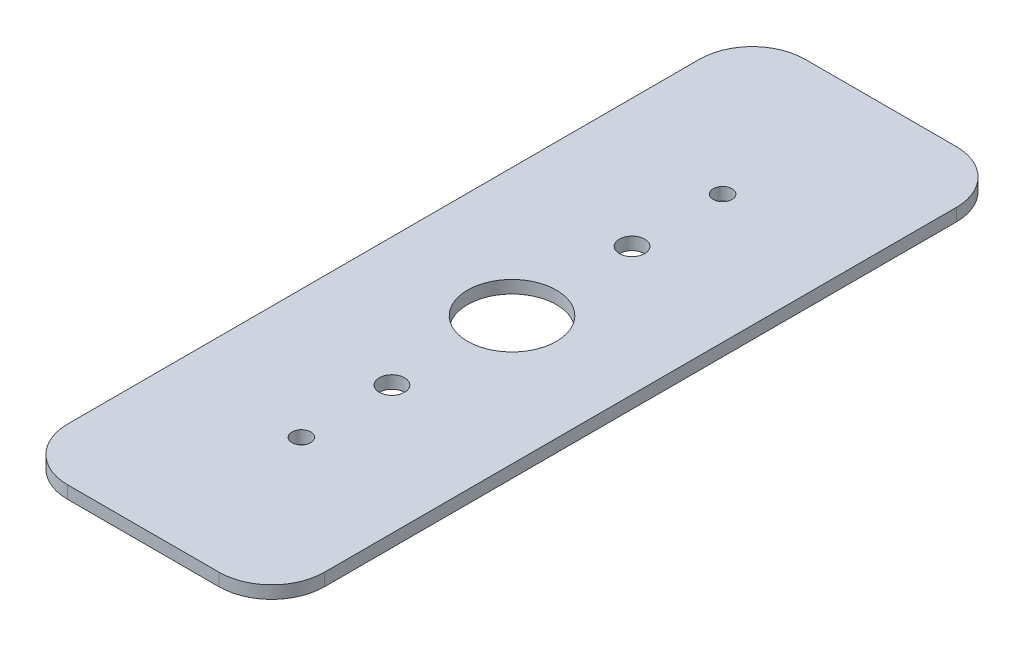
ISO-10303-21;
HEADER;
FILE_DESCRIPTION(('STEP AP214'),'2;1');
FILE_NAME('part.step','',(''),(''),'','','');
FILE_SCHEMA(('AUTOMOTIVE_DESIGN { 1 0 10303 214 1 1 1 1 }'));
ENDSEC;
DATA;
#1=APPLICATION_CONTEXT('core data for automotive mechanical design processes');
#2=APPLICATION_PROTOCOL_DEFINITION('international standard','automotive_design',2000,#1);
#3=PRODUCT_CONTEXT('',#1,'mechanical');
#4=PRODUCT('Part','Part','',(#3));
#5=PRODUCT_RELATED_PRODUCT_CATEGORY('part','',(#4));
#6=PRODUCT_DEFINITION_FORMATION('','',#4);
#7=PRODUCT_DEFINITION_CONTEXT('part definition',#1,'design');
#8=PRODUCT_DEFINITION('design','',#6,#7);
#9=PRODUCT_DEFINITION_SHAPE('','',#8);
#10=(LENGTH_UNIT() NAMED_UNIT(*) SI_UNIT(.MILLI.,.METRE.));
#11=(NAMED_UNIT(*) PLANE_ANGLE_UNIT() SI_UNIT($,.RADIAN.));
#12=(NAMED_UNIT(*) SI_UNIT($,.STERADIAN.) SOLID_ANGLE_UNIT());
#13=UNCERTAINTY_MEASURE_WITH_UNIT(LENGTH_MEASURE(1.E-05),#10,'distance_accuracy_value','');
#14=(GEOMETRIC_REPRESENTATION_CONTEXT(3) GLOBAL_UNCERTAINTY_ASSIGNED_CONTEXT((#13)) GLOBAL_UNIT_ASSIGNED_CONTEXT((#10,
#11,#12)) REPRESENTATION_CONTEXT('',''));
#15=CARTESIAN_POINT('',(0.,0.,0.));
#16=DIRECTION('',(0.,0.,1.));
#17=DIRECTION('',(1.,0.,0.));
#18=AXIS2_PLACEMENT_3D('',#15,#16,#17);
#19=CARTESIAN_POINT('',(-15.478125,1.524,-44.45));
#20=DIRECTION('',(0.,0.,1.));
#21=DIRECTION('',(1.,0.,0.));
#22=AXIS2_PLACEMENT_3D('',#19,#20,#21);
#23=PLANE('',#22);
#24=DIRECTION('',(-1.,0.,0.));
#25=VECTOR('',#24,1.);
#26=CARTESIAN_POINT('',(-15.478125,1.524,-44.45));
#27=LINE('',#26,#25);
#28=CARTESIAN_POINT('',(9.128125,1.524,-44.45));
#29=VERTEX_POINT('',#28);
#30=CARTESIAN_POINT('',(-9.128125,1.524,-44.45));
#31=VERTEX_POINT('',#30);
#32=EDGE_CURVE('E119',#29,#31,#27,.T.);
#33=ORIENTED_EDGE('',*,*,#32,.F.);
#34=DIRECTION('',(0.,-1.,0.));
#35=VECTOR('',#34,1.);
#36=CARTESIAN_POINT('',(9.128125,1.524,-44.45));
#37=LINE('',#36,#35);
#38=CARTESIAN_POINT('',(9.128125,0.,-44.45));
#39=VERTEX_POINT('',#38);
#40=EDGE_CURVE('E104',#29,#39,#37,.T.);
#41=ORIENTED_EDGE('',*,*,#40,.T.);
#42=DIRECTION('',(-1.,0.,0.));
#43=VECTOR('',#42,1.);
#44=CARTESIAN_POINT('',(-15.478125,0.,-44.45));
#45=LINE('',#44,#43);
#46=CARTESIAN_POINT('',(-9.128125,0.,-44.45));
#47=VERTEX_POINT('',#46);
#48=EDGE_CURVE('E116',#39,#47,#45,.T.);
#49=ORIENTED_EDGE('',*,*,#48,.T.);
#50=DIRECTION('',(0.,-1.,0.));
#51=VECTOR('',#50,1.);
#52=CARTESIAN_POINT('',(-9.128125,1.524,-44.45));
#53=LINE('',#52,#51);
#54=EDGE_CURVE('E121',#47,#31,#53,.F.);
#55=ORIENTED_EDGE('',*,*,#54,.T.);
#56=EDGE_LOOP('',(#33,#41,#49,#55));
#57=FACE_BOUND('',#56,.T.);
#58=ADVANCED_FACE('F35',(#57),#23,.F.);
#59=CARTESIAN_POINT('',(-15.478125,1.524,44.45));
#60=DIRECTION('',(1.,0.,0.));
#61=DIRECTION('',(0.,0.,-1.));
#62=AXIS2_PLACEMENT_3D('',#59,#60,#61);
#63=PLANE('',#62);
#64=DIRECTION('',(0.,0.,1.));
#65=VECTOR('',#64,1.);
#66=CARTESIAN_POINT('',(-15.478125,1.524,44.45));
#67=LINE('',#66,#65);
#68=CARTESIAN_POINT('',(-15.478125,1.524,-38.1));
#69=VERTEX_POINT('',#68);
#70=CARTESIAN_POINT('',(-15.478125,1.524,38.1));
#71=VERTEX_POINT('',#70);
#72=EDGE_CURVE('E174',#69,#71,#67,.T.);
#73=ORIENTED_EDGE('',*,*,#72,.F.);
#74=DIRECTION('',(0.,-1.,0.));
#75=VECTOR('',#74,1.);
#76=CARTESIAN_POINT('',(-15.478125,1.524,-38.1));
#77=LINE('',#76,#75);
#78=CARTESIAN_POINT('',(-15.478125,0.,-38.1));
#79=VERTEX_POINT('',#78);
#80=EDGE_CURVE('E158',#69,#79,#77,.T.);
#81=ORIENTED_EDGE('',*,*,#80,.T.);
#82=DIRECTION('',(0.,0.,1.));
#83=VECTOR('',#82,1.);
#84=CARTESIAN_POINT('',(-15.478125,0.,44.45));
#85=LINE('',#84,#83);
#86=CARTESIAN_POINT('',(-15.478125,0.,38.1));
#87=VERTEX_POINT('',#86);
#88=EDGE_CURVE('E125',#79,#87,#85,.T.);
#89=ORIENTED_EDGE('',*,*,#88,.T.);
#90=DIRECTION('',(0.,-1.,0.));
#91=VECTOR('',#90,1.);
#92=CARTESIAN_POINT('',(-15.478125,1.524,38.1));
#93=LINE('',#92,#91);
#94=EDGE_CURVE('E156',#87,#71,#93,.F.);
#95=ORIENTED_EDGE('',*,*,#94,.T.);
#96=EDGE_LOOP('',(#73,#81,#89,#95));
#97=FACE_BOUND('',#96,.T.);
#98=ADVANCED_FACE('F237',(#97),#63,.F.);
#99=CARTESIAN_POINT('',(-15.478125,1.524,44.45));
#100=DIRECTION('',(0.,0.,-1.));
#101=DIRECTION('',(-1.,0.,0.));
#102=AXIS2_PLACEMENT_3D('',#99,#100,#101);
#103=PLANE('',#102);
#104=DIRECTION('',(1.,0.,0.));
#105=VECTOR('',#104,1.);
#106=CARTESIAN_POINT('',(-15.478125,0.,44.45));
#107=LINE('',#106,#105);
#108=CARTESIAN_POINT('',(-9.128125,0.,44.45));
#109=VERTEX_POINT('',#108);
#110=CARTESIAN_POINT('',(9.128125,0.,44.45));
#111=VERTEX_POINT('',#110);
#112=EDGE_CURVE('E129',#109,#111,#107,.T.);
#113=ORIENTED_EDGE('',*,*,#112,.T.);
#114=DIRECTION('',(0.,-1.,0.));
#115=VECTOR('',#114,1.);
#116=CARTESIAN_POINT('',(9.128125,1.524,44.45));
#117=LINE('',#116,#115);
#118=CARTESIAN_POINT('',(9.128125,1.524,44.45));
#119=VERTEX_POINT('',#118);
#120=EDGE_CURVE('E11',#111,#119,#117,.F.);
#121=ORIENTED_EDGE('',*,*,#120,.T.);
#122=DIRECTION('',(1.,0.,0.));
#123=VECTOR('',#122,1.);
#124=CARTESIAN_POINT('',(-15.478125,1.524,44.45));
#125=LINE('',#124,#123);
#126=CARTESIAN_POINT('',(-9.128125,1.524,44.45));
#127=VERTEX_POINT('',#126);
#128=EDGE_CURVE('E164',#127,#119,#125,.T.);
#129=ORIENTED_EDGE('',*,*,#128,.F.);
#130=DIRECTION('',(0.,-1.,0.));
#131=VECTOR('',#130,1.);
#132=CARTESIAN_POINT('',(-9.128125,1.524,44.45));
#133=LINE('',#132,#131);
#134=EDGE_CURVE('E43',#127,#109,#133,.T.);
#135=ORIENTED_EDGE('',*,*,#134,.T.);
#136=EDGE_LOOP('',(#113,#121,#129,#135));
#137=FACE_BOUND('',#136,.T.);
#138=ADVANCED_FACE('F163',(#137),#103,.F.);
#139=CARTESIAN_POINT('',(15.478125,1.524,-44.45));
#140=DIRECTION('',(-1.,0.,0.));
#141=DIRECTION('',(0.,0.,1.));
#142=AXIS2_PLACEMENT_3D('',#139,#140,#141);
#143=PLANE('',#142);
#144=DIRECTION('',(0.,0.,-1.));
#145=VECTOR('',#144,1.);
#146=CARTESIAN_POINT('',(15.478125,0.,-44.45));
#147=LINE('',#146,#145);
#148=CARTESIAN_POINT('',(15.478125,0.,38.1));
#149=VERTEX_POINT('',#148);
#150=CARTESIAN_POINT('',(15.478125,0.,-38.1));
#151=VERTEX_POINT('',#150);
#152=EDGE_CURVE('E139',#149,#151,#147,.T.);
#153=ORIENTED_EDGE('',*,*,#152,.T.);
#154=DIRECTION('',(0.,-1.,0.));
#155=VECTOR('',#154,1.);
#156=CARTESIAN_POINT('',(15.478125,1.524,-38.1));
#157=LINE('',#156,#155);
#158=CARTESIAN_POINT('',(15.478125,1.524,-38.1));
#159=VERTEX_POINT('',#158);
#160=EDGE_CURVE('E105',#151,#159,#157,.F.);
#161=ORIENTED_EDGE('',*,*,#160,.T.);
#162=DIRECTION('',(0.,0.,-1.));
#163=VECTOR('',#162,1.);
#164=CARTESIAN_POINT('',(15.478125,1.524,-44.45));
#165=LINE('',#164,#163);
#166=CARTESIAN_POINT('',(15.478125,1.524,38.1));
#167=VERTEX_POINT('',#166);
#168=EDGE_CURVE('E135',#167,#159,#165,.T.);
#169=ORIENTED_EDGE('',*,*,#168,.F.);
#170=DIRECTION('',(0.,-1.,0.));
#171=VECTOR('',#170,1.);
#172=CARTESIAN_POINT('',(15.478125,1.524,38.1));
#173=LINE('',#172,#171);
#174=EDGE_CURVE('E110',#167,#149,#173,.T.);
#175=ORIENTED_EDGE('',*,*,#174,.T.);
#176=EDGE_LOOP('',(#153,#161,#169,#175));
#177=FACE_BOUND('',#176,.T.);
#178=ADVANCED_FACE('F172',(#177),#143,.F.);
#179=CARTESIAN_POINT('',(15.478125,1.524,-44.45));
#180=DIRECTION('',(0.,-1.,0.));
#181=DIRECTION('',(0.,0.,-1.));
#182=AXIS2_PLACEMENT_3D('',#179,#180,#181);
#183=PLANE('',#182);
#184=CARTESIAN_POINT('',(0.,1.524,0.));
#185=DIRECTION('',(0.,1.,0.));
#186=DIRECTION('',(0.,0.,1.));
#187=AXIS2_PLACEMENT_3D('',#184,#185,#186);
#188=CIRCLE('',#187,5.35812999999999);
#189=CARTESIAN_POINT('',(0.,1.524,5.35812999999999));
#190=VERTEX_POINT('',#189);
#191=EDGE_CURVE('E201',#190,#190,#188,.T.);
#192=ORIENTED_EDGE('',*,*,#191,.F.);
#193=EDGE_LOOP('',(#192));
#194=FACE_BOUND('',#193,.T.);
#195=CARTESIAN_POINT('',(0.,1.524,25.4));
#196=DIRECTION('',(0.,1.,0.));
#197=DIRECTION('',(0.,0.,1.));
#198=AXIS2_PLACEMENT_3D('',#195,#196,#197);
#199=CIRCLE('',#198,1.1303);
#200=CARTESIAN_POINT('',(0.,1.524,26.5303));
#201=VERTEX_POINT('',#200);
#202=EDGE_CURVE('E195',#201,#201,#199,.T.);
#203=ORIENTED_EDGE('',*,*,#202,.F.);
#204=EDGE_LOOP('',(#203));
#205=FACE_BOUND('',#204,.T.);
#206=CARTESIAN_POINT('',(0.,1.524,-25.4));
#207=DIRECTION('',(0.,1.,0.));
#208=DIRECTION('',(0.,0.,1.));
#209=AXIS2_PLACEMENT_3D('',#206,#207,#208);
#210=CIRCLE('',#209,1.1303);
#211=CARTESIAN_POINT('',(0.,1.524,-24.2697));
#212=VERTEX_POINT('',#211);
#213=EDGE_CURVE('E189',#212,#212,#210,.T.);
#214=ORIENTED_EDGE('',*,*,#213,.F.);
#215=EDGE_LOOP('',(#214));
#216=FACE_BOUND('',#215,.T.);
#217=CARTESIAN_POINT('',(0.,1.524,-14.478));
#218=DIRECTION('',(0.,-1.,0.));
#219=DIRECTION('',(0.,0.,1.));
#220=AXIS2_PLACEMENT_3D('',#217,#218,#219);
#221=CIRCLE('',#220,1.524);
#222=CARTESIAN_POINT('',(0.,1.524,-12.954));
#223=VERTEX_POINT('',#222);
#224=EDGE_CURVE('E179',#223,#223,#221,.T.);
#225=ORIENTED_EDGE('',*,*,#224,.T.);
#226=EDGE_LOOP('',(#225));
#227=FACE_BOUND('',#226,.T.);
#228=CARTESIAN_POINT('',(0.,1.524,14.478));
#229=DIRECTION('',(0.,-1.,0.));
#230=DIRECTION('',(0.,0.,-1.));
#231=AXIS2_PLACEMENT_3D('',#228,#229,#230);
#232=CIRCLE('',#231,1.524);
#233=CARTESIAN_POINT('',(0.,1.524,12.954));
#234=VERTEX_POINT('',#233);
#235=EDGE_CURVE('E126',#234,#234,#232,.T.);
#236=ORIENTED_EDGE('',*,*,#235,.T.);
#237=EDGE_LOOP('',(#236));
#238=FACE_BOUND('',#237,.T.);
#239=ORIENTED_EDGE('',*,*,#168,.T.);
#240=CARTESIAN_POINT('',(9.128125,1.524,-38.1));
#241=DIRECTION('',(0.,-1.,0.));
#242=DIRECTION('',(0.,0.,-1.));
#243=AXIS2_PLACEMENT_3D('',#240,#241,#242);
#244=CIRCLE('',#243,6.35);
#245=EDGE_CURVE('E154',#159,#29,#244,.F.);
#246=ORIENTED_EDGE('',*,*,#245,.T.);
#247=ORIENTED_EDGE('',*,*,#32,.T.);
#248=CARTESIAN_POINT('',(-9.128125,1.524,-38.1));
#249=DIRECTION('',(0.,-1.,0.));
#250=DIRECTION('',(0.,0.,-1.));
#251=AXIS2_PLACEMENT_3D('',#248,#249,#250);
#252=CIRCLE('',#251,6.35);
#253=EDGE_CURVE('E152',#31,#69,#252,.F.);
#254=ORIENTED_EDGE('',*,*,#253,.T.);
#255=ORIENTED_EDGE('',*,*,#72,.T.);
#256=CARTESIAN_POINT('',(-9.128125,1.524,38.1));
#257=DIRECTION('',(0.,-1.,0.));
#258=DIRECTION('',(0.,0.,-1.));
#259=AXIS2_PLACEMENT_3D('',#256,#257,#258);
#260=CIRCLE('',#259,6.35);
#261=EDGE_CURVE('E55',#71,#127,#260,.F.);
#262=ORIENTED_EDGE('',*,*,#261,.T.);
#263=ORIENTED_EDGE('',*,*,#128,.T.);
#264=CARTESIAN_POINT('',(9.128125,1.524,38.1));
#265=DIRECTION('',(0.,-1.,0.));
#266=DIRECTION('',(0.,0.,-1.));
#267=AXIS2_PLACEMENT_3D('',#264,#265,#266);
#268=CIRCLE('',#267,6.35);
#269=EDGE_CURVE('E150',#119,#167,#268,.F.);
#270=ORIENTED_EDGE('',*,*,#269,.T.);
#271=EDGE_LOOP('',(#239,#246,#247,#254,#255,#262,#263,#270));
#272=FACE_BOUND('',#271,.T.);
#273=ADVANCED_FACE('F207',(#194,#205,#216,#227,#238,#272),#183,.F.);
#274=CARTESIAN_POINT('',(15.478125,0.,-44.45));
#275=DIRECTION('',(0.,-1.,0.));
#276=DIRECTION('',(0.,0.,-1.));
#277=AXIS2_PLACEMENT_3D('',#274,#275,#276);
#278=PLANE('',#277);
#279=CARTESIAN_POINT('',(0.,0.,0.));
#280=DIRECTION('',(0.,1.,0.));
#281=DIRECTION('',(0.,0.,1.));
#282=AXIS2_PLACEMENT_3D('',#279,#280,#281);
#283=CIRCLE('',#282,5.35813);
#284=CARTESIAN_POINT('',(0.,0.,5.35813));
#285=VERTEX_POINT('',#284);
#286=EDGE_CURVE('E198',#285,#285,#283,.T.);
#287=ORIENTED_EDGE('',*,*,#286,.T.);
#288=EDGE_LOOP('',(#287));
#289=FACE_BOUND('',#288,.T.);
#290=CARTESIAN_POINT('',(0.,0.,25.4));
#291=DIRECTION('',(0.,1.,0.));
#292=DIRECTION('',(0.,0.,1.));
#293=AXIS2_PLACEMENT_3D('',#290,#291,#292);
#294=CIRCLE('',#293,1.1303);
#295=CARTESIAN_POINT('',(0.,0.,26.5303));
#296=VERTEX_POINT('',#295);
#297=EDGE_CURVE('E192',#296,#296,#294,.T.);
#298=ORIENTED_EDGE('',*,*,#297,.T.);
#299=EDGE_LOOP('',(#298));
#300=FACE_BOUND('',#299,.T.);
#301=CARTESIAN_POINT('',(0.,0.,-25.4));
#302=DIRECTION('',(0.,1.,0.));
#303=DIRECTION('',(0.,0.,1.));
#304=AXIS2_PLACEMENT_3D('',#301,#302,#303);
#305=CIRCLE('',#304,1.1303);
#306=CARTESIAN_POINT('',(0.,0.,-24.2697));
#307=VERTEX_POINT('',#306);
#308=EDGE_CURVE('E184',#307,#307,#305,.T.);
#309=ORIENTED_EDGE('',*,*,#308,.T.);
#310=EDGE_LOOP('',(#309));
#311=FACE_BOUND('',#310,.T.);
#312=CARTESIAN_POINT('',(0.,0.,-14.478));
#313=DIRECTION('',(0.,-1.,0.));
#314=DIRECTION('',(0.,0.,1.));
#315=AXIS2_PLACEMENT_3D('',#312,#313,#314);
#316=CIRCLE('',#315,1.524);
#317=CARTESIAN_POINT('',(0.,0.,-12.954));
#318=VERTEX_POINT('',#317);
#319=EDGE_CURVE('E181',#318,#318,#316,.T.);
#320=ORIENTED_EDGE('',*,*,#319,.F.);
#321=EDGE_LOOP('',(#320));
#322=FACE_BOUND('',#321,.T.);
#323=CARTESIAN_POINT('',(0.,0.,14.478));
#324=DIRECTION('',(0.,-1.,0.));
#325=DIRECTION('',(0.,0.,-1.));
#326=AXIS2_PLACEMENT_3D('',#323,#324,#325);
#327=CIRCLE('',#326,1.524);
#328=CARTESIAN_POINT('',(0.,0.,12.954));
#329=VERTEX_POINT('',#328);
#330=EDGE_CURVE('E132',#329,#329,#327,.T.);
#331=ORIENTED_EDGE('',*,*,#330,.F.);
#332=EDGE_LOOP('',(#331));
#333=FACE_BOUND('',#332,.T.);
#334=ORIENTED_EDGE('',*,*,#48,.F.);
#335=CARTESIAN_POINT('',(9.128125,0.,-38.1));
#336=DIRECTION('',(0.,-1.,0.));
#337=DIRECTION('',(0.,0.,-1.));
#338=AXIS2_PLACEMENT_3D('',#335,#336,#337);
#339=CIRCLE('',#338,6.35);
#340=EDGE_CURVE('E100',#39,#151,#339,.T.);
#341=ORIENTED_EDGE('',*,*,#340,.T.);
#342=ORIENTED_EDGE('',*,*,#152,.F.);
#343=CARTESIAN_POINT('',(9.128125,0.,38.1));
#344=DIRECTION('',(0.,-1.,0.));
#345=DIRECTION('',(0.,0.,-1.));
#346=AXIS2_PLACEMENT_3D('',#343,#344,#345);
#347=CIRCLE('',#346,6.35);
#348=EDGE_CURVE('E143',#149,#111,#347,.T.);
#349=ORIENTED_EDGE('',*,*,#348,.T.);
#350=ORIENTED_EDGE('',*,*,#112,.F.);
#351=CARTESIAN_POINT('',(-9.128125,0.,38.1));
#352=DIRECTION('',(0.,-1.,0.));
#353=DIRECTION('',(0.,0.,-1.));
#354=AXIS2_PLACEMENT_3D('',#351,#352,#353);
#355=CIRCLE('',#354,6.35);
#356=EDGE_CURVE('E120',#109,#87,#355,.T.);
#357=ORIENTED_EDGE('',*,*,#356,.T.);
#358=ORIENTED_EDGE('',*,*,#88,.F.);
#359=CARTESIAN_POINT('',(-9.128125,0.,-38.1));
#360=DIRECTION('',(0.,-1.,0.));
#361=DIRECTION('',(0.,0.,-1.));
#362=AXIS2_PLACEMENT_3D('',#359,#360,#361);
#363=CIRCLE('',#362,6.35);
#364=EDGE_CURVE('E111',#79,#47,#363,.T.);
#365=ORIENTED_EDGE('',*,*,#364,.T.);
#366=EDGE_LOOP('',(#334,#341,#342,#349,#350,#357,#358,#365));
#367=FACE_BOUND('',#366,.T.);
#368=ADVANCED_FACE('F123',(#289,#300,#311,#322,#333,#367),#278,.T.);
#369=CARTESIAN_POINT('',(9.128125,1.524,-38.1));
#370=DIRECTION('',(0.,-1.,0.));
#371=DIRECTION('',(0.,0.,-1.));
#372=AXIS2_PLACEMENT_3D('',#369,#370,#371);
#373=CYLINDRICAL_SURFACE('',#372,6.35);
#374=ORIENTED_EDGE('',*,*,#245,.F.);
#375=ORIENTED_EDGE('',*,*,#160,.F.);
#376=ORIENTED_EDGE('',*,*,#340,.F.);
#377=ORIENTED_EDGE('',*,*,#40,.F.);
#378=EDGE_LOOP('',(#374,#375,#376,#377));
#379=FACE_BOUND('',#378,.T.);
#380=ADVANCED_FACE('F103',(#379),#373,.T.);
#381=CARTESIAN_POINT('',(-9.128125,1.524,-38.1));
#382=DIRECTION('',(0.,-1.,0.));
#383=DIRECTION('',(0.,0.,-1.));
#384=AXIS2_PLACEMENT_3D('',#381,#382,#383);
#385=CYLINDRICAL_SURFACE('',#384,6.35);
#386=ORIENTED_EDGE('',*,*,#253,.F.);
#387=ORIENTED_EDGE('',*,*,#54,.F.);
#388=ORIENTED_EDGE('',*,*,#364,.F.);
#389=ORIENTED_EDGE('',*,*,#80,.F.);
#390=EDGE_LOOP('',(#386,#387,#388,#389));
#391=FACE_BOUND('',#390,.T.);
#392=ADVANCED_FACE('F232',(#391),#385,.T.);
#393=CARTESIAN_POINT('',(9.128125,1.524,38.1));
#394=DIRECTION('',(0.,-1.,0.));
#395=DIRECTION('',(0.,0.,-1.));
#396=AXIS2_PLACEMENT_3D('',#393,#394,#395);
#397=CYLINDRICAL_SURFACE('',#396,6.35);
#398=ORIENTED_EDGE('',*,*,#269,.F.);
#399=ORIENTED_EDGE('',*,*,#120,.F.);
#400=ORIENTED_EDGE('',*,*,#348,.F.);
#401=ORIENTED_EDGE('',*,*,#174,.F.);
#402=EDGE_LOOP('',(#398,#399,#400,#401));
#403=FACE_BOUND('',#402,.T.);
#404=ADVANCED_FACE('F169',(#403),#397,.T.);
#405=CARTESIAN_POINT('',(-9.128125,1.524,38.1));
#406=DIRECTION('',(0.,-1.,0.));
#407=DIRECTION('',(0.,0.,-1.));
#408=AXIS2_PLACEMENT_3D('',#405,#406,#407);
#409=CYLINDRICAL_SURFACE('',#408,6.35);
#410=ORIENTED_EDGE('',*,*,#261,.F.);
#411=ORIENTED_EDGE('',*,*,#94,.F.);
#412=ORIENTED_EDGE('',*,*,#356,.F.);
#413=ORIENTED_EDGE('',*,*,#134,.F.);
#414=EDGE_LOOP('',(#410,#411,#412,#413));
#415=FACE_BOUND('',#414,.T.);
#416=ADVANCED_FACE('F37',(#415),#409,.T.);
#417=CARTESIAN_POINT('',(0.,1.524,14.478));
#418=DIRECTION('',(0.,-1.,0.));
#419=DIRECTION('',(0.,0.,-1.));
#420=AXIS2_PLACEMENT_3D('',#417,#418,#419);
#421=CYLINDRICAL_SURFACE('',#420,1.524);
#422=ORIENTED_EDGE('',*,*,#235,.F.);
#423=EDGE_LOOP('',(#422));
#424=FACE_BOUND('',#423,.T.);
#425=ORIENTED_EDGE('',*,*,#330,.T.);
#426=EDGE_LOOP('',(#425));
#427=FACE_BOUND('',#426,.T.);
#428=ADVANCED_FACE('F219',(#424,#427),#421,.F.);
#429=CARTESIAN_POINT('',(0.,1.524,-14.478));
#430=DIRECTION('',(0.,-1.,0.));
#431=DIRECTION('',(0.,0.,-1.));
#432=AXIS2_PLACEMENT_3D('',#429,#430,#431);
#433=CYLINDRICAL_SURFACE('',#432,1.524);
#434=ORIENTED_EDGE('',*,*,#224,.F.);
#435=EDGE_LOOP('',(#434));
#436=FACE_BOUND('',#435,.T.);
#437=ORIENTED_EDGE('',*,*,#319,.T.);
#438=EDGE_LOOP('',(#437));
#439=FACE_BOUND('',#438,.T.);
#440=ADVANCED_FACE('F222',(#436,#439),#433,.F.);
#441=CARTESIAN_POINT('',(0.,1.524,-25.4));
#442=DIRECTION('',(0.,1.,0.));
#443=DIRECTION('',(0.,0.,1.));
#444=AXIS2_PLACEMENT_3D('',#441,#442,#443);
#445=CYLINDRICAL_SURFACE('',#444,1.1303);
#446=ORIENTED_EDGE('',*,*,#308,.F.);
#447=EDGE_LOOP('',(#446));
#448=FACE_BOUND('',#447,.T.);
#449=ORIENTED_EDGE('',*,*,#213,.T.);
#450=EDGE_LOOP('',(#449));
#451=FACE_BOUND('',#450,.T.);
#452=ADVANCED_FACE('F268',(#448,#451),#445,.F.);
#453=CARTESIAN_POINT('',(0.,1.524,25.4));
#454=DIRECTION('',(0.,1.,0.));
#455=DIRECTION('',(0.,0.,1.));
#456=AXIS2_PLACEMENT_3D('',#453,#454,#455);
#457=CYLINDRICAL_SURFACE('',#456,1.1303);
#458=ORIENTED_EDGE('',*,*,#297,.F.);
#459=EDGE_LOOP('',(#458));
#460=FACE_BOUND('',#459,.T.);
#461=ORIENTED_EDGE('',*,*,#202,.T.);
#462=EDGE_LOOP('',(#461));
#463=FACE_BOUND('',#462,.T.);
#464=ADVANCED_FACE('F277',(#460,#463),#457,.F.);
#465=CARTESIAN_POINT('',(0.,1.524,0.));
#466=DIRECTION('',(0.,1.,0.));
#467=DIRECTION('',(0.,0.,1.));
#468=AXIS2_PLACEMENT_3D('',#465,#466,#467);
#469=CYLINDRICAL_SURFACE('',#468,5.35812999999999);
#470=ORIENTED_EDGE('',*,*,#286,.F.);
#471=EDGE_LOOP('',(#470));
#472=FACE_BOUND('',#471,.T.);
#473=ORIENTED_EDGE('',*,*,#191,.T.);
#474=EDGE_LOOP('',(#473));
#475=FACE_BOUND('',#474,.T.);
#476=ADVANCED_FACE('F205',(#472,#475),#469,.F.);
#477=CLOSED_SHELL('',(#58,#98,#138,#178,#273,#368,#380,#392,#404,#416,#428,#440,#452,#464,#476));
#478=MANIFOLD_SOLID_BREP('B2',#477);
#479=ADVANCED_BREP_SHAPE_REPRESENTATION('',(#18,#478),#14);
#480=SHAPE_DEFINITION_REPRESENTATION(#9,#479);
ENDSEC;
END-ISO-10303-21;
